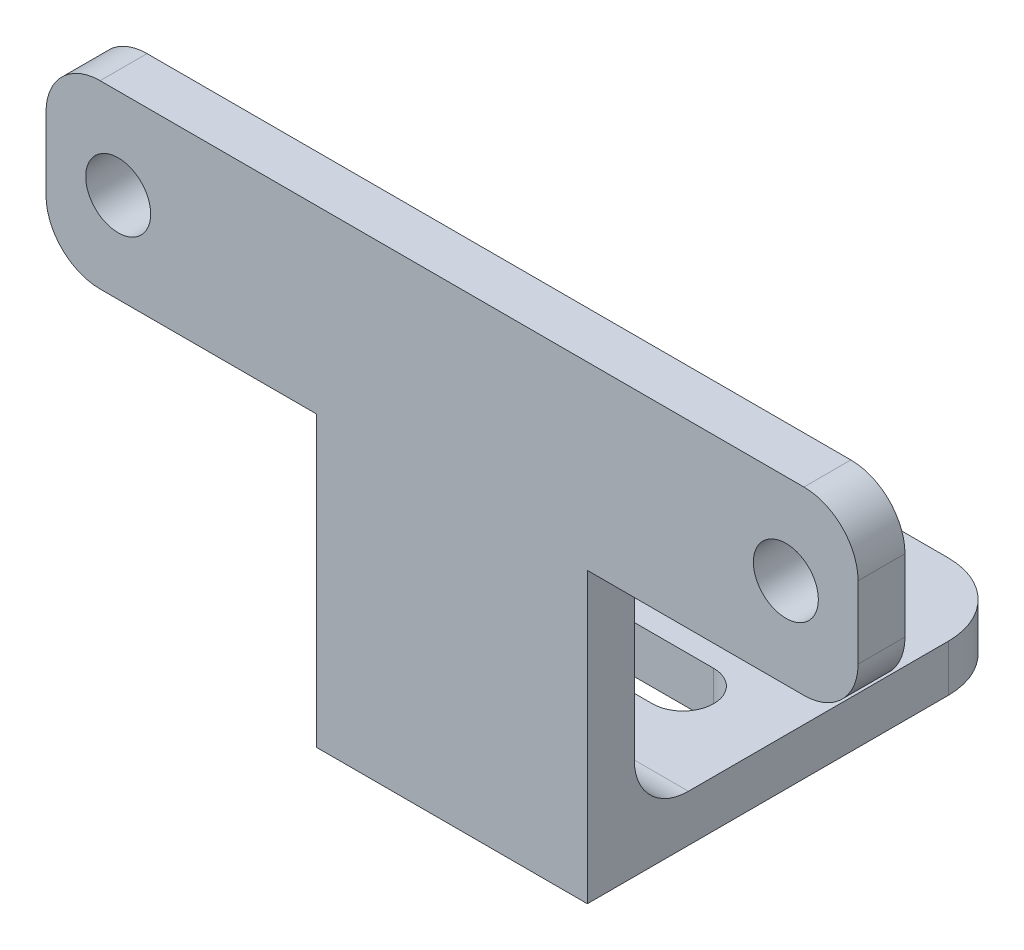
ISO-10303-21;
HEADER;
FILE_DESCRIPTION(('STEP AP214'),'2;1');
FILE_NAME('part.step','',(''),(''),'','','');
FILE_SCHEMA(('AUTOMOTIVE_DESIGN { 1 0 10303 214 1 1 1 1 }'));
ENDSEC;
DATA;
#1=APPLICATION_CONTEXT('core data for automotive mechanical design processes');
#2=APPLICATION_PROTOCOL_DEFINITION('international standard','automotive_design',2000,#1);
#3=PRODUCT_CONTEXT('',#1,'mechanical');
#4=PRODUCT('Part','Part','',(#3));
#5=PRODUCT_RELATED_PRODUCT_CATEGORY('part','',(#4));
#6=PRODUCT_DEFINITION_FORMATION('','',#4);
#7=PRODUCT_DEFINITION_CONTEXT('part definition',#1,'design');
#8=PRODUCT_DEFINITION('design','',#6,#7);
#9=PRODUCT_DEFINITION_SHAPE('','',#8);
#10=(LENGTH_UNIT() NAMED_UNIT(*) SI_UNIT(.MILLI.,.METRE.));
#11=(NAMED_UNIT(*) PLANE_ANGLE_UNIT() SI_UNIT($,.RADIAN.));
#12=(NAMED_UNIT(*) SI_UNIT($,.STERADIAN.) SOLID_ANGLE_UNIT());
#13=UNCERTAINTY_MEASURE_WITH_UNIT(LENGTH_MEASURE(1.E-05),#10,'distance_accuracy_value','');
#14=(GEOMETRIC_REPRESENTATION_CONTEXT(3) GLOBAL_UNCERTAINTY_ASSIGNED_CONTEXT((#13)) GLOBAL_UNIT_ASSIGNED_CONTEXT((#10,
#11,#12)) REPRESENTATION_CONTEXT('',''));
#15=CARTESIAN_POINT('',(0.,0.,0.));
#16=DIRECTION('',(0.,0.,1.));
#17=DIRECTION('',(1.,0.,0.));
#18=AXIS2_PLACEMENT_3D('',#15,#16,#17);
#19=CARTESIAN_POINT('',(-7.5,2.6,-24.));
#20=DIRECTION('',(1.,0.,0.));
#21=DIRECTION('',(0.,0.,-1.));
#22=AXIS2_PLACEMENT_3D('',#19,#20,#21);
#23=PLANE('',#22);
#24=DIRECTION('',(0.,0.,1.));
#25=VECTOR('',#24,1.);
#26=CARTESIAN_POINT('',(-7.5,2.6,-24.));
#27=LINE('',#26,#25);
#28=CARTESIAN_POINT('',(-7.5,2.6,-20.));
#29=VERTEX_POINT('',#28);
#30=CARTESIAN_POINT('',(-7.5,2.6,-5.6));
#31=VERTEX_POINT('',#30);
#32=EDGE_CURVE('E452',#29,#31,#27,.T.);
#33=ORIENTED_EDGE('',*,*,#32,.F.);
#34=DIRECTION('',(0.,-1.,0.));
#35=VECTOR('',#34,1.);
#36=CARTESIAN_POINT('',(-7.5,2.6,-20.));
#37=LINE('',#36,#35);
#38=CARTESIAN_POINT('',(-7.5,0.,-20.));
#39=VERTEX_POINT('',#38);
#40=EDGE_CURVE('E475',#29,#39,#37,.T.);
#41=ORIENTED_EDGE('',*,*,#40,.T.);
#42=DIRECTION('',(0.,0.,1.));
#43=VECTOR('',#42,1.);
#44=CARTESIAN_POINT('',(-7.5,0.,-24.));
#45=LINE('',#44,#43);
#46=CARTESIAN_POINT('',(-7.5,0.,0.));
#47=VERTEX_POINT('',#46);
#48=EDGE_CURVE('E449',#39,#47,#45,.T.);
#49=ORIENTED_EDGE('',*,*,#48,.T.);
#50=DIRECTION('',(0.,-1.,0.));
#51=VECTOR('',#50,1.);
#52=CARTESIAN_POINT('',(-7.5,2.6,0.));
#53=LINE('',#52,#51);
#54=CARTESIAN_POINT('',(-7.50000000000001,16.,0.));
#55=VERTEX_POINT('',#54);
#56=EDGE_CURVE('E472',#55,#47,#53,.T.);
#57=ORIENTED_EDGE('',*,*,#56,.F.);
#58=DIRECTION('',(0.,0.,1.));
#59=VECTOR('',#58,1.);
#60=CARTESIAN_POINT('',(-7.50000000000001,16.,-2.6));
#61=LINE('',#60,#59);
#62=CARTESIAN_POINT('',(-7.50000000000001,16.,-2.6));
#63=VERTEX_POINT('',#62);
#64=EDGE_CURVE('E446',#63,#55,#61,.T.);
#65=ORIENTED_EDGE('',*,*,#64,.F.);
#66=DIRECTION('',(0.,1.,0.));
#67=VECTOR('',#66,1.);
#68=CARTESIAN_POINT('',(-7.5,0.,-2.6));
#69=LINE('',#68,#67);
#70=CARTESIAN_POINT('',(-7.5,5.6,-2.6));
#71=VERTEX_POINT('',#70);
#72=EDGE_CURVE('E432',#71,#63,#69,.T.);
#73=ORIENTED_EDGE('',*,*,#72,.F.);
#74=CARTESIAN_POINT('',(-7.5,5.6,-5.6));
#75=DIRECTION('',(1.,0.,0.));
#76=DIRECTION('',(0.,0.,-1.));
#77=AXIS2_PLACEMENT_3D('',#74,#75,#76);
#78=CIRCLE('',#77,3.);
#79=EDGE_CURVE('E537',#71,#31,#78,.T.);
#80=ORIENTED_EDGE('',*,*,#79,.T.);
#81=EDGE_LOOP('',(#33,#41,#49,#57,#65,#73,#80));
#82=FACE_BOUND('',#81,.T.);
#83=ADVANCED_FACE('F185',(#82),#23,.F.);
#84=CARTESIAN_POINT('',(-7.5,2.6,0.));
#85=DIRECTION('',(0.,0.,-1.));
#86=DIRECTION('',(-1.,0.,0.));
#87=AXIS2_PLACEMENT_3D('',#84,#85,#86);
#88=PLANE('',#87);
#89=CARTESIAN_POINT('',(-18.5,21.,0.));
#90=DIRECTION('',(0.,0.,1.));
#91=DIRECTION('',(1.,0.,0.));
#92=AXIS2_PLACEMENT_3D('',#89,#90,#91);
#93=CIRCLE('',#92,1.8);
#94=CARTESIAN_POINT('',(-16.7,21.,0.));
#95=VERTEX_POINT('',#94);
#96=EDGE_CURVE('E405',#95,#95,#93,.T.);
#97=ORIENTED_EDGE('',*,*,#96,.F.);
#98=EDGE_LOOP('',(#97));
#99=FACE_BOUND('',#98,.T.);
#100=CARTESIAN_POINT('',(18.5,21.,0.));
#101=DIRECTION('',(0.,0.,1.));
#102=DIRECTION('',(1.,0.,0.));
#103=AXIS2_PLACEMENT_3D('',#100,#101,#102);
#104=CIRCLE('',#103,1.8);
#105=CARTESIAN_POINT('',(20.3,21.,0.));
#106=VERTEX_POINT('',#105);
#107=EDGE_CURVE('E409',#106,#106,#104,.T.);
#108=ORIENTED_EDGE('',*,*,#107,.F.);
#109=EDGE_LOOP('',(#108));
#110=FACE_BOUND('',#109,.T.);
#111=DIRECTION('',(0.,1.,0.));
#112=VECTOR('',#111,1.);
#113=CARTESIAN_POINT('',(-22.5,0.,0.));
#114=LINE('',#113,#112);
#115=CARTESIAN_POINT('',(-22.5,19.,0.));
#116=VERTEX_POINT('',#115);
#117=CARTESIAN_POINT('',(-22.5,23.,0.));
#118=VERTEX_POINT('',#117);
#119=EDGE_CURVE('E443',#116,#118,#114,.T.);
#120=ORIENTED_EDGE('',*,*,#119,.F.);
#121=CARTESIAN_POINT('',(-19.5,19.,0.));
#122=DIRECTION('',(0.,0.,-1.));
#123=DIRECTION('',(-1.,0.,0.));
#124=AXIS2_PLACEMENT_3D('',#121,#122,#123);
#125=CIRCLE('',#124,3.);
#126=CARTESIAN_POINT('',(-19.5,16.,0.));
#127=VERTEX_POINT('',#126);
#128=EDGE_CURVE('E507',#116,#127,#125,.F.);
#129=ORIENTED_EDGE('',*,*,#128,.T.);
#130=DIRECTION('',(1.,0.,0.));
#131=VECTOR('',#130,1.);
#132=CARTESIAN_POINT('',(0.,16.,0.));
#133=LINE('',#132,#131);
#134=EDGE_CURVE('E419',#127,#55,#133,.T.);
#135=ORIENTED_EDGE('',*,*,#134,.T.);
#136=ORIENTED_EDGE('',*,*,#56,.T.);
#137=DIRECTION('',(1.,0.,0.));
#138=VECTOR('',#137,1.);
#139=CARTESIAN_POINT('',(-7.5,0.,0.));
#140=LINE('',#139,#138);
#141=CARTESIAN_POINT('',(7.5,0.,0.));
#142=VERTEX_POINT('',#141);
#143=EDGE_CURVE('E463',#47,#142,#140,.T.);
#144=ORIENTED_EDGE('',*,*,#143,.T.);
#145=DIRECTION('',(0.,-1.,0.));
#146=VECTOR('',#145,1.);
#147=CARTESIAN_POINT('',(7.5,2.6,0.));
#148=LINE('',#147,#146);
#149=CARTESIAN_POINT('',(7.5,16.,0.));
#150=VERTEX_POINT('',#149);
#151=EDGE_CURVE('E461',#150,#142,#148,.T.);
#152=ORIENTED_EDGE('',*,*,#151,.F.);
#153=CARTESIAN_POINT('',(19.5,16.,0.));
#154=VERTEX_POINT('',#153);
#155=EDGE_CURVE('E415',#150,#154,#133,.T.);
#156=ORIENTED_EDGE('',*,*,#155,.T.);
#157=CARTESIAN_POINT('',(19.5,19.,0.));
#158=DIRECTION('',(0.,0.,-1.));
#159=DIRECTION('',(-1.,0.,0.));
#160=AXIS2_PLACEMENT_3D('',#157,#158,#159);
#161=CIRCLE('',#160,3.);
#162=CARTESIAN_POINT('',(22.5,19.,0.));
#163=VERTEX_POINT('',#162);
#164=EDGE_CURVE('E503',#154,#163,#161,.F.);
#165=ORIENTED_EDGE('',*,*,#164,.T.);
#166=DIRECTION('',(0.,1.,0.));
#167=VECTOR('',#166,1.);
#168=CARTESIAN_POINT('',(22.5,0.,0.));
#169=LINE('',#168,#167);
#170=CARTESIAN_POINT('',(22.5,23.,0.));
#171=VERTEX_POINT('',#170);
#172=EDGE_CURVE('E437',#163,#171,#169,.T.);
#173=ORIENTED_EDGE('',*,*,#172,.T.);
#174=CARTESIAN_POINT('',(19.5,23.,0.));
#175=DIRECTION('',(0.,0.,-1.));
#176=DIRECTION('',(-1.,0.,0.));
#177=AXIS2_PLACEMENT_3D('',#174,#175,#176);
#178=CIRCLE('',#177,3.);
#179=CARTESIAN_POINT('',(19.5,26.,0.));
#180=VERTEX_POINT('',#179);
#181=EDGE_CURVE('E501',#171,#180,#178,.F.);
#182=ORIENTED_EDGE('',*,*,#181,.T.);
#183=DIRECTION('',(1.,0.,0.));
#184=VECTOR('',#183,1.);
#185=CARTESIAN_POINT('',(0.,26.,0.));
#186=LINE('',#185,#184);
#187=CARTESIAN_POINT('',(-19.5,26.,0.));
#188=VERTEX_POINT('',#187);
#189=EDGE_CURVE('E440',#188,#180,#186,.T.);
#190=ORIENTED_EDGE('',*,*,#189,.F.);
#191=CARTESIAN_POINT('',(-19.5,23.,0.));
#192=DIRECTION('',(0.,0.,-1.));
#193=DIRECTION('',(-1.,0.,0.));
#194=AXIS2_PLACEMENT_3D('',#191,#192,#193);
#195=CIRCLE('',#194,3.);
#196=EDGE_CURVE('E505',#188,#118,#195,.F.);
#197=ORIENTED_EDGE('',*,*,#196,.T.);
#198=EDGE_LOOP('',(#120,#129,#135,#136,#144,#152,#156,#165,#173,#182,#190,#197));
#199=FACE_BOUND('',#198,.T.);
#200=ADVANCED_FACE('F567',(#99,#110,#199),#88,.F.);
#201=CARTESIAN_POINT('',(7.5,2.6,-24.));
#202=DIRECTION('',(-1.,0.,0.));
#203=DIRECTION('',(0.,0.,1.));
#204=AXIS2_PLACEMENT_3D('',#201,#202,#203);
#205=PLANE('',#204);
#206=DIRECTION('',(0.,0.,-1.));
#207=VECTOR('',#206,1.);
#208=CARTESIAN_POINT('',(7.5,0.,-24.));
#209=LINE('',#208,#207);
#210=CARTESIAN_POINT('',(7.5,0.,-20.));
#211=VERTEX_POINT('',#210);
#212=EDGE_CURVE('E465',#142,#211,#209,.T.);
#213=ORIENTED_EDGE('',*,*,#212,.T.);
#214=DIRECTION('',(0.,-1.,0.));
#215=VECTOR('',#214,1.);
#216=CARTESIAN_POINT('',(7.5,2.6,-20.));
#217=LINE('',#216,#215);
#218=CARTESIAN_POINT('',(7.5,2.6,-20.));
#219=VERTEX_POINT('',#218);
#220=EDGE_CURVE('E491',#211,#219,#217,.F.);
#221=ORIENTED_EDGE('',*,*,#220,.T.);
#222=DIRECTION('',(0.,0.,-1.));
#223=VECTOR('',#222,1.);
#224=CARTESIAN_POINT('',(7.5,2.6,-24.));
#225=LINE('',#224,#223);
#226=CARTESIAN_POINT('',(7.5,2.6,-5.6));
#227=VERTEX_POINT('',#226);
#228=EDGE_CURVE('E455',#227,#219,#225,.T.);
#229=ORIENTED_EDGE('',*,*,#228,.F.);
#230=CARTESIAN_POINT('',(7.5,5.6,-5.6));
#231=DIRECTION('',(-1.,0.,0.));
#232=DIRECTION('',(0.,0.,1.));
#233=AXIS2_PLACEMENT_3D('',#230,#231,#232);
#234=CIRCLE('',#233,3.);
#235=CARTESIAN_POINT('',(7.5,5.6,-2.6));
#236=VERTEX_POINT('',#235);
#237=EDGE_CURVE('E539',#227,#236,#234,.T.);
#238=ORIENTED_EDGE('',*,*,#237,.T.);
#239=DIRECTION('',(0.,1.,0.));
#240=VECTOR('',#239,1.);
#241=CARTESIAN_POINT('',(7.5,0.,-2.6));
#242=LINE('',#241,#240);
#243=CARTESIAN_POINT('',(7.5,16.,-2.6));
#244=VERTEX_POINT('',#243);
#245=EDGE_CURVE('E416',#236,#244,#242,.T.);
#246=ORIENTED_EDGE('',*,*,#245,.T.);
#247=DIRECTION('',(0.,0.,1.));
#248=VECTOR('',#247,1.);
#249=CARTESIAN_POINT('',(7.5,16.,-2.6));
#250=LINE('',#249,#248);
#251=EDGE_CURVE('E434',#244,#150,#250,.T.);
#252=ORIENTED_EDGE('',*,*,#251,.T.);
#253=ORIENTED_EDGE('',*,*,#151,.T.);
#254=EDGE_LOOP('',(#213,#221,#229,#238,#246,#252,#253));
#255=FACE_BOUND('',#254,.T.);
#256=ADVANCED_FACE('F573',(#255),#205,.F.);
#257=CARTESIAN_POINT('',(-7.5,2.6,-24.));
#258=DIRECTION('',(0.,0.,1.));
#259=DIRECTION('',(1.,0.,0.));
#260=AXIS2_PLACEMENT_3D('',#257,#258,#259);
#261=PLANE('',#260);
#262=DIRECTION('',(-1.,0.,0.));
#263=VECTOR('',#262,1.);
#264=CARTESIAN_POINT('',(-7.5,0.,-24.));
#265=LINE('',#264,#263);
#266=CARTESIAN_POINT('',(3.5,0.,-24.));
#267=VERTEX_POINT('',#266);
#268=CARTESIAN_POINT('',(-3.5,0.,-24.));
#269=VERTEX_POINT('',#268);
#270=EDGE_CURVE('E456',#267,#269,#265,.T.);
#271=ORIENTED_EDGE('',*,*,#270,.T.);
#272=DIRECTION('',(0.,-1.,0.));
#273=VECTOR('',#272,1.);
#274=CARTESIAN_POINT('',(-3.5,2.6,-24.));
#275=LINE('',#274,#273);
#276=CARTESIAN_POINT('',(-3.5,2.6,-24.));
#277=VERTEX_POINT('',#276);
#278=EDGE_CURVE('E485',#269,#277,#275,.F.);
#279=ORIENTED_EDGE('',*,*,#278,.T.);
#280=DIRECTION('',(-1.,0.,0.));
#281=VECTOR('',#280,1.);
#282=CARTESIAN_POINT('',(-7.5,2.6,-24.));
#283=LINE('',#282,#281);
#284=CARTESIAN_POINT('',(3.5,2.6,-24.));
#285=VERTEX_POINT('',#284);
#286=EDGE_CURVE('E458',#285,#277,#283,.T.);
#287=ORIENTED_EDGE('',*,*,#286,.F.);
#288=DIRECTION('',(0.,-1.,0.));
#289=VECTOR('',#288,1.);
#290=CARTESIAN_POINT('',(3.5,2.6,-24.));
#291=LINE('',#290,#289);
#292=EDGE_CURVE('E482',#285,#267,#291,.T.);
#293=ORIENTED_EDGE('',*,*,#292,.T.);
#294=EDGE_LOOP('',(#271,#279,#287,#293));
#295=FACE_BOUND('',#294,.T.);
#296=ADVANCED_FACE('F676',(#295),#261,.F.);
#297=CARTESIAN_POINT('',(0.,2.6,0.));
#298=DIRECTION('',(0.,1.,0.));
#299=DIRECTION('',(0.,0.,1.));
#300=AXIS2_PLACEMENT_3D('',#297,#298,#299);
#301=PLANE('',#300);
#302=DIRECTION('',(1.,0.,0.));
#303=VECTOR('',#302,1.);
#304=CARTESIAN_POINT('',(-2.3,2.6,-16.8));
#305=LINE('',#304,#303);
#306=CARTESIAN_POINT('',(-2.3,2.6,-16.8));
#307=VERTEX_POINT('',#306);
#308=CARTESIAN_POINT('',(2.3,2.6,-16.8));
#309=VERTEX_POINT('',#308);
#310=EDGE_CURVE('E370',#307,#309,#305,.T.);
#311=ORIENTED_EDGE('',*,*,#310,.F.);
#312=CARTESIAN_POINT('',(-2.3,2.6,-18.5));
#313=DIRECTION('',(0.,1.,0.));
#314=DIRECTION('',(0.,0.,1.));
#315=AXIS2_PLACEMENT_3D('',#312,#313,#314);
#316=CIRCLE('',#315,1.69999999999999);
#317=CARTESIAN_POINT('',(-2.3,2.6,-20.2));
#318=VERTEX_POINT('',#317);
#319=EDGE_CURVE('E369',#318,#307,#316,.T.);
#320=ORIENTED_EDGE('',*,*,#319,.F.);
#321=DIRECTION('',(1.,0.,0.));
#322=VECTOR('',#321,1.);
#323=CARTESIAN_POINT('',(-2.3,2.6,-20.2));
#324=LINE('',#323,#322);
#325=CARTESIAN_POINT('',(2.3,2.6,-20.2));
#326=VERTEX_POINT('',#325);
#327=EDGE_CURVE('E356',#318,#326,#324,.T.);
#328=ORIENTED_EDGE('',*,*,#327,.T.);
#329=CARTESIAN_POINT('',(2.3,2.6,-18.5));
#330=DIRECTION('',(0.,1.,0.));
#331=DIRECTION('',(0.,0.,1.));
#332=AXIS2_PLACEMENT_3D('',#329,#330,#331);
#333=CIRCLE('',#332,1.69999999999999);
#334=EDGE_CURVE('E360',#309,#326,#333,.T.);
#335=ORIENTED_EDGE('',*,*,#334,.F.);
#336=EDGE_LOOP('',(#311,#320,#328,#335));
#337=FACE_BOUND('',#336,.T.);
#338=CARTESIAN_POINT('',(2.3,2.6,-10.5));
#339=DIRECTION('',(0.,1.,0.));
#340=DIRECTION('',(0.,0.,1.));
#341=AXIS2_PLACEMENT_3D('',#338,#339,#340);
#342=CIRCLE('',#341,1.69999999999999);
#343=CARTESIAN_POINT('',(2.3,2.6,-8.80000000000004));
#344=VERTEX_POINT('',#343);
#345=CARTESIAN_POINT('',(2.3,2.6,-12.2));
#346=VERTEX_POINT('',#345);
#347=EDGE_CURVE('E395',#344,#346,#342,.T.);
#348=ORIENTED_EDGE('',*,*,#347,.F.);
#349=DIRECTION('',(1.,0.,0.));
#350=VECTOR('',#349,1.);
#351=CARTESIAN_POINT('',(-2.3,2.6,-8.80000000000004));
#352=LINE('',#351,#350);
#353=CARTESIAN_POINT('',(-2.3,2.6,-8.80000000000001));
#354=VERTEX_POINT('',#353);
#355=EDGE_CURVE('E382',#354,#344,#352,.T.);
#356=ORIENTED_EDGE('',*,*,#355,.F.);
#357=CARTESIAN_POINT('',(-2.3,2.6,-10.5));
#358=DIRECTION('',(0.,1.,0.));
#359=DIRECTION('',(0.,0.,1.));
#360=AXIS2_PLACEMENT_3D('',#357,#358,#359);
#361=CIRCLE('',#360,1.69999999999999);
#362=CARTESIAN_POINT('',(-2.3,2.6,-12.2));
#363=VERTEX_POINT('',#362);
#364=EDGE_CURVE('E387',#363,#354,#361,.T.);
#365=ORIENTED_EDGE('',*,*,#364,.F.);
#366=DIRECTION('',(1.,0.,0.));
#367=VECTOR('',#366,1.);
#368=CARTESIAN_POINT('',(-2.3,2.6,-12.2));
#369=LINE('',#368,#367);
#370=EDGE_CURVE('E384',#363,#346,#369,.T.);
#371=ORIENTED_EDGE('',*,*,#370,.T.);
#372=EDGE_LOOP('',(#348,#356,#365,#371));
#373=FACE_BOUND('',#372,.T.);
#374=ORIENTED_EDGE('',*,*,#32,.T.);
#375=DIRECTION('',(-1.,0.,0.));
#376=VECTOR('',#375,1.);
#377=CARTESIAN_POINT('',(0.,2.6,-5.6));
#378=LINE('',#377,#376);
#379=EDGE_CURVE('E535',#31,#227,#378,.F.);
#380=ORIENTED_EDGE('',*,*,#379,.T.);
#381=ORIENTED_EDGE('',*,*,#228,.T.);
#382=CARTESIAN_POINT('',(3.5,2.6,-20.));
#383=DIRECTION('',(0.,1.,0.));
#384=DIRECTION('',(0.,0.,1.));
#385=AXIS2_PLACEMENT_3D('',#382,#383,#384);
#386=CIRCLE('',#385,4.);
#387=EDGE_CURVE('E487',#219,#285,#386,.T.);
#388=ORIENTED_EDGE('',*,*,#387,.T.);
#389=ORIENTED_EDGE('',*,*,#286,.T.);
#390=CARTESIAN_POINT('',(-3.5,2.6,-20.));
#391=DIRECTION('',(0.,1.,0.));
#392=DIRECTION('',(0.,0.,1.));
#393=AXIS2_PLACEMENT_3D('',#390,#391,#392);
#394=CIRCLE('',#393,4.);
#395=EDGE_CURVE('E489',#277,#29,#394,.T.);
#396=ORIENTED_EDGE('',*,*,#395,.T.);
#397=EDGE_LOOP('',(#374,#380,#381,#388,#389,#396));
#398=FACE_BOUND('',#397,.T.);
#399=ADVANCED_FACE('F367',(#337,#373,#398),#301,.T.);
#400=CARTESIAN_POINT('',(0.,0.,0.));
#401=DIRECTION('',(0.,1.,0.));
#402=DIRECTION('',(0.,0.,1.));
#403=AXIS2_PLACEMENT_3D('',#400,#401,#402);
#404=PLANE('',#403);
#405=CARTESIAN_POINT('',(2.3,0.,-18.5));
#406=DIRECTION('',(0.,1.,0.));
#407=DIRECTION('',(0.,0.,1.));
#408=AXIS2_PLACEMENT_3D('',#405,#406,#407);
#409=CIRCLE('',#408,1.69999999999999);
#410=CARTESIAN_POINT('',(2.3,0.,-16.8));
#411=VERTEX_POINT('',#410);
#412=CARTESIAN_POINT('',(2.3,0.,-20.2));
#413=VERTEX_POINT('',#412);
#414=EDGE_CURVE('E193',#411,#413,#409,.T.);
#415=ORIENTED_EDGE('',*,*,#414,.T.);
#416=DIRECTION('',(-1.,0.,0.));
#417=VECTOR('',#416,1.);
#418=CARTESIAN_POINT('',(0.,0.,-20.2));
#419=LINE('',#418,#417);
#420=CARTESIAN_POINT('',(-2.3,0.,-20.2));
#421=VERTEX_POINT('',#420);
#422=EDGE_CURVE('E13',#413,#421,#419,.T.);
#423=ORIENTED_EDGE('',*,*,#422,.T.);
#424=CARTESIAN_POINT('',(-2.3,0.,-18.5));
#425=DIRECTION('',(0.,1.,0.));
#426=DIRECTION('',(0.,0.,1.));
#427=AXIS2_PLACEMENT_3D('',#424,#425,#426);
#428=CIRCLE('',#427,1.69999999999999);
#429=CARTESIAN_POINT('',(-2.3,0.,-16.8));
#430=VERTEX_POINT('',#429);
#431=EDGE_CURVE('E379',#421,#430,#428,.T.);
#432=ORIENTED_EDGE('',*,*,#431,.T.);
#433=DIRECTION('',(1.,0.,0.));
#434=VECTOR('',#433,1.);
#435=CARTESIAN_POINT('',(0.,0.,-16.8));
#436=LINE('',#435,#434);
#437=EDGE_CURVE('E550',#430,#411,#436,.T.);
#438=ORIENTED_EDGE('',*,*,#437,.T.);
#439=EDGE_LOOP('',(#415,#423,#432,#438));
#440=FACE_BOUND('',#439,.T.);
#441=CARTESIAN_POINT('',(2.3,0.,-10.5));
#442=DIRECTION('',(0.,1.,0.));
#443=DIRECTION('',(0.,0.,1.));
#444=AXIS2_PLACEMENT_3D('',#441,#442,#443);
#445=CIRCLE('',#444,1.69999999999999);
#446=CARTESIAN_POINT('',(2.3,0.,-8.80000000000002));
#447=VERTEX_POINT('',#446);
#448=CARTESIAN_POINT('',(2.3,0.,-12.2));
#449=VERTEX_POINT('',#448);
#450=EDGE_CURVE('E402',#447,#449,#445,.T.);
#451=ORIENTED_EDGE('',*,*,#450,.T.);
#452=DIRECTION('',(-1.,0.,0.));
#453=VECTOR('',#452,1.);
#454=CARTESIAN_POINT('',(0.,0.,-12.2));
#455=LINE('',#454,#453);
#456=CARTESIAN_POINT('',(-2.3,0.,-12.2));
#457=VERTEX_POINT('',#456);
#458=EDGE_CURVE('E547',#449,#457,#455,.T.);
#459=ORIENTED_EDGE('',*,*,#458,.T.);
#460=CARTESIAN_POINT('',(-2.3,0.,-10.5));
#461=DIRECTION('',(0.,1.,0.));
#462=DIRECTION('',(0.,0.,1.));
#463=AXIS2_PLACEMENT_3D('',#460,#461,#462);
#464=CIRCLE('',#463,1.69999999999999);
#465=CARTESIAN_POINT('',(-2.3,0.,-8.80000000000002));
#466=VERTEX_POINT('',#465);
#467=EDGE_CURVE('E544',#457,#466,#464,.T.);
#468=ORIENTED_EDGE('',*,*,#467,.T.);
#469=DIRECTION('',(1.,0.,0.));
#470=VECTOR('',#469,1.);
#471=CARTESIAN_POINT('',(0.,0.,-8.80000000000002));
#472=LINE('',#471,#470);
#473=EDGE_CURVE('E541',#466,#447,#472,.T.);
#474=ORIENTED_EDGE('',*,*,#473,.T.);
#475=EDGE_LOOP('',(#451,#459,#468,#474));
#476=FACE_BOUND('',#475,.T.);
#477=ORIENTED_EDGE('',*,*,#48,.F.);
#478=CARTESIAN_POINT('',(-3.5,0.,-20.));
#479=DIRECTION('',(0.,1.,0.));
#480=DIRECTION('',(0.,0.,1.));
#481=AXIS2_PLACEMENT_3D('',#478,#479,#480);
#482=CIRCLE('',#481,4.);
#483=EDGE_CURVE('E480',#39,#269,#482,.F.);
#484=ORIENTED_EDGE('',*,*,#483,.T.);
#485=ORIENTED_EDGE('',*,*,#270,.F.);
#486=CARTESIAN_POINT('',(3.5,0.,-20.));
#487=DIRECTION('',(0.,1.,0.));
#488=DIRECTION('',(0.,0.,1.));
#489=AXIS2_PLACEMENT_3D('',#486,#487,#488);
#490=CIRCLE('',#489,4.);
#491=EDGE_CURVE('E478',#267,#211,#490,.F.);
#492=ORIENTED_EDGE('',*,*,#491,.T.);
#493=ORIENTED_EDGE('',*,*,#212,.F.);
#494=ORIENTED_EDGE('',*,*,#143,.F.);
#495=EDGE_LOOP('',(#477,#484,#485,#492,#493,#494));
#496=FACE_BOUND('',#495,.T.);
#497=ADVANCED_FACE('F553',(#440,#476,#496),#404,.F.);
#498=CARTESIAN_POINT('',(0.,16.,-2.6));
#499=DIRECTION('',(0.,-1.,0.));
#500=DIRECTION('',(1.,0.,0.));
#501=AXIS2_PLACEMENT_3D('',#498,#499,#500);
#502=PLANE('',#501);
#503=ORIENTED_EDGE('',*,*,#134,.F.);
#504=DIRECTION('',(0.,0.,1.));
#505=VECTOR('',#504,1.);
#506=CARTESIAN_POINT('',(-19.5,16.,-2.6));
#507=LINE('',#506,#505);
#508=CARTESIAN_POINT('',(-19.5,16.,-2.6));
#509=VERTEX_POINT('',#508);
#510=EDGE_CURVE('E509',#127,#509,#507,.F.);
#511=ORIENTED_EDGE('',*,*,#510,.T.);
#512=DIRECTION('',(1.,0.,0.));
#513=VECTOR('',#512,1.);
#514=CARTESIAN_POINT('',(0.,16.,-2.6));
#515=LINE('',#514,#513);
#516=EDGE_CURVE('E423',#509,#63,#515,.T.);
#517=ORIENTED_EDGE('',*,*,#516,.T.);
#518=ORIENTED_EDGE('',*,*,#64,.T.);
#519=EDGE_LOOP('',(#503,#511,#517,#518));
#520=FACE_BOUND('',#519,.T.);
#521=ADVANCED_FACE('F650',(#520),#502,.T.);
#522=CARTESIAN_POINT('',(-22.5,0.,-2.6));
#523=DIRECTION('',(1.,0.,0.));
#524=DIRECTION('',(0.,1.,0.));
#525=AXIS2_PLACEMENT_3D('',#522,#523,#524);
#526=PLANE('',#525);
#527=DIRECTION('',(0.,1.,0.));
#528=VECTOR('',#527,1.);
#529=CARTESIAN_POINT('',(-22.5,0.,-2.6));
#530=LINE('',#529,#528);
#531=CARTESIAN_POINT('',(-22.5,19.,-2.6));
#532=VERTEX_POINT('',#531);
#533=CARTESIAN_POINT('',(-22.5,23.,-2.6));
#534=VERTEX_POINT('',#533);
#535=EDGE_CURVE('E429',#532,#534,#530,.T.);
#536=ORIENTED_EDGE('',*,*,#535,.F.);
#537=DIRECTION('',(0.,0.,1.));
#538=VECTOR('',#537,1.);
#539=CARTESIAN_POINT('',(-22.5,19.,0.));
#540=LINE('',#539,#538);
#541=EDGE_CURVE('E498',#532,#116,#540,.T.);
#542=ORIENTED_EDGE('',*,*,#541,.T.);
#543=ORIENTED_EDGE('',*,*,#119,.T.);
#544=DIRECTION('',(0.,0.,1.));
#545=VECTOR('',#544,1.);
#546=CARTESIAN_POINT('',(-22.5,23.,-2.6));
#547=LINE('',#546,#545);
#548=EDGE_CURVE('E494',#118,#534,#547,.F.);
#549=ORIENTED_EDGE('',*,*,#548,.T.);
#550=EDGE_LOOP('',(#536,#542,#543,#549));
#551=FACE_BOUND('',#550,.T.);
#552=ADVANCED_FACE('F657',(#551),#526,.F.);
#553=CARTESIAN_POINT('',(0.,26.,-2.6));
#554=DIRECTION('',(0.,-1.,0.));
#555=DIRECTION('',(1.,0.,0.));
#556=AXIS2_PLACEMENT_3D('',#553,#554,#555);
#557=PLANE('',#556);
#558=DIRECTION('',(1.,0.,0.));
#559=VECTOR('',#558,1.);
#560=CARTESIAN_POINT('',(0.,26.,-2.6));
#561=LINE('',#560,#559);
#562=CARTESIAN_POINT('',(-19.5,26.,-2.6));
#563=VERTEX_POINT('',#562);
#564=CARTESIAN_POINT('',(19.5,26.,-2.6));
#565=VERTEX_POINT('',#564);
#566=EDGE_CURVE('E426',#563,#565,#561,.T.);
#567=ORIENTED_EDGE('',*,*,#566,.F.);
#568=DIRECTION('',(0.,0.,1.));
#569=VECTOR('',#568,1.);
#570=CARTESIAN_POINT('',(-19.5,26.,-2.6));
#571=LINE('',#570,#569);
#572=EDGE_CURVE('E521',#563,#188,#571,.T.);
#573=ORIENTED_EDGE('',*,*,#572,.T.);
#574=ORIENTED_EDGE('',*,*,#189,.T.);
#575=DIRECTION('',(0.,0.,1.));
#576=VECTOR('',#575,1.);
#577=CARTESIAN_POINT('',(19.5,26.,-2.6));
#578=LINE('',#577,#576);
#579=EDGE_CURVE('E519',#180,#565,#578,.F.);
#580=ORIENTED_EDGE('',*,*,#579,.T.);
#581=EDGE_LOOP('',(#567,#573,#574,#580));
#582=FACE_BOUND('',#581,.T.);
#583=ADVANCED_FACE('F663',(#582),#557,.F.);
#584=CARTESIAN_POINT('',(22.5,0.,-2.6));
#585=DIRECTION('',(1.,0.,0.));
#586=DIRECTION('',(0.,0.,-1.));
#587=AXIS2_PLACEMENT_3D('',#584,#585,#586);
#588=PLANE('',#587);
#589=ORIENTED_EDGE('',*,*,#172,.F.);
#590=DIRECTION('',(0.,0.,1.));
#591=VECTOR('',#590,1.);
#592=CARTESIAN_POINT('',(22.5,19.,-2.6));
#593=LINE('',#592,#591);
#594=CARTESIAN_POINT('',(22.5,19.,-2.6));
#595=VERTEX_POINT('',#594);
#596=EDGE_CURVE('E530',#163,#595,#593,.F.);
#597=ORIENTED_EDGE('',*,*,#596,.T.);
#598=DIRECTION('',(0.,1.,0.));
#599=VECTOR('',#598,1.);
#600=CARTESIAN_POINT('',(22.5,0.,-2.6));
#601=LINE('',#600,#599);
#602=CARTESIAN_POINT('',(22.5,23.,-2.6));
#603=VERTEX_POINT('',#602);
#604=EDGE_CURVE('E422',#595,#603,#601,.T.);
#605=ORIENTED_EDGE('',*,*,#604,.T.);
#606=DIRECTION('',(0.,0.,1.));
#607=VECTOR('',#606,1.);
#608=CARTESIAN_POINT('',(22.5,23.,0.));
#609=LINE('',#608,#607);
#610=EDGE_CURVE('E527',#603,#171,#609,.T.);
#611=ORIENTED_EDGE('',*,*,#610,.T.);
#612=EDGE_LOOP('',(#589,#597,#605,#611));
#613=FACE_BOUND('',#612,.T.);
#614=ADVANCED_FACE('F619',(#613),#588,.T.);
#615=CARTESIAN_POINT('',(19.5,16.,-2.6));
#616=VERTEX_POINT('',#615);
#617=EDGE_CURVE('E418',#244,#616,#515,.T.);
#618=ORIENTED_EDGE('',*,*,#617,.T.);
#619=DIRECTION('',(0.,0.,1.));
#620=VECTOR('',#619,1.);
#621=CARTESIAN_POINT('',(19.5,16.,-2.6));
#622=LINE('',#621,#620);
#623=EDGE_CURVE('E524',#616,#154,#622,.T.);
#624=ORIENTED_EDGE('',*,*,#623,.T.);
#625=ORIENTED_EDGE('',*,*,#155,.F.);
#626=ORIENTED_EDGE('',*,*,#251,.F.);
#627=EDGE_LOOP('',(#618,#624,#625,#626));
#628=FACE_BOUND('',#627,.T.);
#629=ADVANCED_FACE('F625',(#628),#502,.T.);
#630=CARTESIAN_POINT('',(0.,0.,-2.6));
#631=DIRECTION('',(0.,0.,1.));
#632=DIRECTION('',(1.,0.,0.));
#633=AXIS2_PLACEMENT_3D('',#630,#631,#632);
#634=PLANE('',#633);
#635=CARTESIAN_POINT('',(-18.5,21.,-2.6));
#636=DIRECTION('',(0.,0.,1.));
#637=DIRECTION('',(1.,0.,0.));
#638=AXIS2_PLACEMENT_3D('',#635,#636,#637);
#639=CIRCLE('',#638,1.79999999999999);
#640=CARTESIAN_POINT('',(-16.7,21.,-2.6));
#641=VERTEX_POINT('',#640);
#642=EDGE_CURVE('E408',#641,#641,#639,.T.);
#643=ORIENTED_EDGE('',*,*,#642,.T.);
#644=EDGE_LOOP('',(#643));
#645=FACE_BOUND('',#644,.T.);
#646=CARTESIAN_POINT('',(18.5,21.,-2.6));
#647=DIRECTION('',(0.,0.,1.));
#648=DIRECTION('',(1.,0.,0.));
#649=AXIS2_PLACEMENT_3D('',#646,#647,#648);
#650=CIRCLE('',#649,1.79999999999999);
#651=CARTESIAN_POINT('',(20.3,21.,-2.6));
#652=VERTEX_POINT('',#651);
#653=EDGE_CURVE('E412',#652,#652,#650,.T.);
#654=ORIENTED_EDGE('',*,*,#653,.T.);
#655=EDGE_LOOP('',(#654));
#656=FACE_BOUND('',#655,.T.);
#657=ORIENTED_EDGE('',*,*,#245,.F.);
#658=DIRECTION('',(-1.,0.,0.));
#659=VECTOR('',#658,1.);
#660=CARTESIAN_POINT('',(0.,5.6,-2.6));
#661=LINE('',#660,#659);
#662=EDGE_CURVE('E532',#236,#71,#661,.T.);
#663=ORIENTED_EDGE('',*,*,#662,.T.);
#664=ORIENTED_EDGE('',*,*,#72,.T.);
#665=ORIENTED_EDGE('',*,*,#516,.F.);
#666=CARTESIAN_POINT('',(-19.5,19.,-2.6));
#667=DIRECTION('',(0.,0.,1.));
#668=DIRECTION('',(1.,0.,0.));
#669=AXIS2_PLACEMENT_3D('',#666,#667,#668);
#670=CIRCLE('',#669,3.);
#671=EDGE_CURVE('E517',#509,#532,#670,.F.);
#672=ORIENTED_EDGE('',*,*,#671,.T.);
#673=ORIENTED_EDGE('',*,*,#535,.T.);
#674=CARTESIAN_POINT('',(-19.5,23.,-2.6));
#675=DIRECTION('',(0.,0.,1.));
#676=DIRECTION('',(1.,0.,0.));
#677=AXIS2_PLACEMENT_3D('',#674,#675,#676);
#678=CIRCLE('',#677,3.);
#679=EDGE_CURVE('E515',#534,#563,#678,.F.);
#680=ORIENTED_EDGE('',*,*,#679,.T.);
#681=ORIENTED_EDGE('',*,*,#566,.T.);
#682=CARTESIAN_POINT('',(19.5,23.,-2.6));
#683=DIRECTION('',(0.,0.,1.));
#684=DIRECTION('',(1.,0.,0.));
#685=AXIS2_PLACEMENT_3D('',#682,#683,#684);
#686=CIRCLE('',#685,3.);
#687=EDGE_CURVE('E511',#565,#603,#686,.F.);
#688=ORIENTED_EDGE('',*,*,#687,.T.);
#689=ORIENTED_EDGE('',*,*,#604,.F.);
#690=CARTESIAN_POINT('',(19.5,19.,-2.6));
#691=DIRECTION('',(0.,0.,1.));
#692=DIRECTION('',(1.,0.,0.));
#693=AXIS2_PLACEMENT_3D('',#690,#691,#692);
#694=CIRCLE('',#693,3.);
#695=EDGE_CURVE('E513',#595,#616,#694,.F.);
#696=ORIENTED_EDGE('',*,*,#695,.T.);
#697=ORIENTED_EDGE('',*,*,#617,.F.);
#698=EDGE_LOOP('',(#657,#663,#664,#665,#672,#673,#680,#681,#688,#689,#696,#697));
#699=FACE_BOUND('',#698,.T.);
#700=ADVANCED_FACE('F583',(#645,#656,#699),#634,.F.);
#701=CARTESIAN_POINT('',(-3.5,2.6,-20.));
#702=DIRECTION('',(0.,-1.,0.));
#703=DIRECTION('',(0.,0.,-1.));
#704=AXIS2_PLACEMENT_3D('',#701,#702,#703);
#705=CYLINDRICAL_SURFACE('',#704,4.);
#706=ORIENTED_EDGE('',*,*,#395,.F.);
#707=ORIENTED_EDGE('',*,*,#278,.F.);
#708=ORIENTED_EDGE('',*,*,#483,.F.);
#709=ORIENTED_EDGE('',*,*,#40,.F.);
#710=EDGE_LOOP('',(#706,#707,#708,#709));
#711=FACE_BOUND('',#710,.T.);
#712=ADVANCED_FACE('F579',(#711),#705,.T.);
#713=CARTESIAN_POINT('',(3.5,2.6,-20.));
#714=DIRECTION('',(0.,-1.,0.));
#715=DIRECTION('',(0.,0.,-1.));
#716=AXIS2_PLACEMENT_3D('',#713,#714,#715);
#717=CYLINDRICAL_SURFACE('',#716,4.);
#718=ORIENTED_EDGE('',*,*,#387,.F.);
#719=ORIENTED_EDGE('',*,*,#220,.F.);
#720=ORIENTED_EDGE('',*,*,#491,.F.);
#721=ORIENTED_EDGE('',*,*,#292,.F.);
#722=EDGE_LOOP('',(#718,#719,#720,#721));
#723=FACE_BOUND('',#722,.T.);
#724=ADVANCED_FACE('F582',(#723),#717,.T.);
#725=CARTESIAN_POINT('',(18.5,21.,0.));
#726=DIRECTION('',(0.,0.,1.));
#727=DIRECTION('',(1.,0.,0.));
#728=AXIS2_PLACEMENT_3D('',#725,#726,#727);
#729=CYLINDRICAL_SURFACE('',#728,1.79999999999999);
#730=ORIENTED_EDGE('',*,*,#107,.T.);
#731=EDGE_LOOP('',(#730));
#732=FACE_BOUND('',#731,.T.);
#733=ORIENTED_EDGE('',*,*,#653,.F.);
#734=EDGE_LOOP('',(#733));
#735=FACE_BOUND('',#734,.T.);
#736=ADVANCED_FACE('F587',(#732,#735),#729,.F.);
#737=CARTESIAN_POINT('',(-18.5,21.,0.));
#738=DIRECTION('',(0.,0.,1.));
#739=DIRECTION('',(1.,0.,0.));
#740=AXIS2_PLACEMENT_3D('',#737,#738,#739);
#741=CYLINDRICAL_SURFACE('',#740,1.79999999999999);
#742=ORIENTED_EDGE('',*,*,#96,.T.);
#743=EDGE_LOOP('',(#742));
#744=FACE_BOUND('',#743,.T.);
#745=ORIENTED_EDGE('',*,*,#642,.F.);
#746=EDGE_LOOP('',(#745));
#747=FACE_BOUND('',#746,.T.);
#748=ADVANCED_FACE('F593',(#744,#747),#741,.F.);
#749=CARTESIAN_POINT('',(-19.5,19.,-2.6));
#750=DIRECTION('',(0.,0.,-1.));
#751=DIRECTION('',(-1.,0.,0.));
#752=AXIS2_PLACEMENT_3D('',#749,#750,#751);
#753=CYLINDRICAL_SURFACE('',#752,3.);
#754=ORIENTED_EDGE('',*,*,#671,.F.);
#755=ORIENTED_EDGE('',*,*,#510,.F.);
#756=ORIENTED_EDGE('',*,*,#128,.F.);
#757=ORIENTED_EDGE('',*,*,#541,.F.);
#758=EDGE_LOOP('',(#754,#755,#756,#757));
#759=FACE_BOUND('',#758,.T.);
#760=ADVANCED_FACE('F589',(#759),#753,.T.);
#761=CARTESIAN_POINT('',(-19.5,23.,-2.6));
#762=DIRECTION('',(0.,0.,1.));
#763=DIRECTION('',(1.,0.,0.));
#764=AXIS2_PLACEMENT_3D('',#761,#762,#763);
#765=CYLINDRICAL_SURFACE('',#764,3.);
#766=ORIENTED_EDGE('',*,*,#679,.F.);
#767=ORIENTED_EDGE('',*,*,#548,.F.);
#768=ORIENTED_EDGE('',*,*,#196,.F.);
#769=ORIENTED_EDGE('',*,*,#572,.F.);
#770=EDGE_LOOP('',(#766,#767,#768,#769));
#771=FACE_BOUND('',#770,.T.);
#772=ADVANCED_FACE('F592',(#771),#765,.T.);
#773=CARTESIAN_POINT('',(19.5,19.,-2.6));
#774=DIRECTION('',(0.,0.,1.));
#775=DIRECTION('',(1.,0.,0.));
#776=AXIS2_PLACEMENT_3D('',#773,#774,#775);
#777=CYLINDRICAL_SURFACE('',#776,3.);
#778=ORIENTED_EDGE('',*,*,#695,.F.);
#779=ORIENTED_EDGE('',*,*,#596,.F.);
#780=ORIENTED_EDGE('',*,*,#164,.F.);
#781=ORIENTED_EDGE('',*,*,#623,.F.);
#782=EDGE_LOOP('',(#778,#779,#780,#781));
#783=FACE_BOUND('',#782,.T.);
#784=ADVANCED_FACE('F597',(#783),#777,.T.);
#785=CARTESIAN_POINT('',(19.5,23.,-2.6));
#786=DIRECTION('',(0.,0.,-1.));
#787=DIRECTION('',(-1.,0.,0.));
#788=AXIS2_PLACEMENT_3D('',#785,#786,#787);
#789=CYLINDRICAL_SURFACE('',#788,3.);
#790=ORIENTED_EDGE('',*,*,#687,.F.);
#791=ORIENTED_EDGE('',*,*,#579,.F.);
#792=ORIENTED_EDGE('',*,*,#181,.F.);
#793=ORIENTED_EDGE('',*,*,#610,.F.);
#794=EDGE_LOOP('',(#790,#791,#792,#793));
#795=FACE_BOUND('',#794,.T.);
#796=ADVANCED_FACE('F600',(#795),#789,.T.);
#797=CARTESIAN_POINT('',(0.,5.6,-5.6));
#798=DIRECTION('',(-1.,0.,0.));
#799=DIRECTION('',(0.,0.,1.));
#800=AXIS2_PLACEMENT_3D('',#797,#798,#799);
#801=CYLINDRICAL_SURFACE('',#800,3.);
#802=ORIENTED_EDGE('',*,*,#237,.F.);
#803=ORIENTED_EDGE('',*,*,#379,.F.);
#804=ORIENTED_EDGE('',*,*,#79,.F.);
#805=ORIENTED_EDGE('',*,*,#662,.F.);
#806=EDGE_LOOP('',(#802,#803,#804,#805));
#807=FACE_BOUND('',#806,.T.);
#808=ADVANCED_FACE('F187',(#807),#801,.F.);
#809=CARTESIAN_POINT('',(-2.3,2.6,-12.2));
#810=DIRECTION('',(0.,0.,-1.));
#811=DIRECTION('',(-1.,0.,0.));
#812=AXIS2_PLACEMENT_3D('',#809,#810,#811);
#813=PLANE('',#812);
#814=DIRECTION('',(0.,1.,0.));
#815=VECTOR('',#814,1.);
#816=CARTESIAN_POINT('',(2.3,2.6,-12.2));
#817=LINE('',#816,#815);
#818=EDGE_CURVE('E398',#449,#346,#817,.T.);
#819=ORIENTED_EDGE('',*,*,#818,.T.);
#820=ORIENTED_EDGE('',*,*,#370,.F.);
#821=DIRECTION('',(0.,1.,0.));
#822=VECTOR('',#821,1.);
#823=CARTESIAN_POINT('',(-2.3,2.6,-12.2));
#824=LINE('',#823,#822);
#825=EDGE_CURVE('E392',#363,#457,#824,.F.);
#826=ORIENTED_EDGE('',*,*,#825,.T.);
#827=ORIENTED_EDGE('',*,*,#458,.F.);
#828=EDGE_LOOP('',(#819,#820,#826,#827));
#829=FACE_BOUND('',#828,.T.);
#830=ADVANCED_FACE('F607',(#829),#813,.F.);
#831=CARTESIAN_POINT('',(-2.3,2.6,-10.5));
#832=DIRECTION('',(0.,1.,0.));
#833=DIRECTION('',(0.,0.,1.));
#834=AXIS2_PLACEMENT_3D('',#831,#832,#833);
#835=CYLINDRICAL_SURFACE('',#834,1.69999999999999);
#836=ORIENTED_EDGE('',*,*,#825,.F.);
#837=ORIENTED_EDGE('',*,*,#364,.T.);
#838=DIRECTION('',(0.,1.,0.));
#839=VECTOR('',#838,1.);
#840=CARTESIAN_POINT('',(-2.3,2.6,-8.80000000000002));
#841=LINE('',#840,#839);
#842=EDGE_CURVE('E390',#466,#354,#841,.T.);
#843=ORIENTED_EDGE('',*,*,#842,.F.);
#844=ORIENTED_EDGE('',*,*,#467,.F.);
#845=EDGE_LOOP('',(#836,#837,#843,#844));
#846=FACE_BOUND('',#845,.T.);
#847=ADVANCED_FACE('F835',(#846),#835,.F.);
#848=CARTESIAN_POINT('',(-2.3,2.6,-8.80000000000002));
#849=DIRECTION('',(0.,0.,1.));
#850=DIRECTION('',(1.,0.,0.));
#851=AXIS2_PLACEMENT_3D('',#848,#849,#850);
#852=PLANE('',#851);
#853=ORIENTED_EDGE('',*,*,#842,.T.);
#854=ORIENTED_EDGE('',*,*,#355,.T.);
#855=DIRECTION('',(0.,1.,0.));
#856=VECTOR('',#855,1.);
#857=CARTESIAN_POINT('',(2.3,2.6,-8.80000000000002));
#858=LINE('',#857,#856);
#859=EDGE_CURVE('E400',#344,#447,#858,.F.);
#860=ORIENTED_EDGE('',*,*,#859,.T.);
#861=ORIENTED_EDGE('',*,*,#473,.F.);
#862=EDGE_LOOP('',(#853,#854,#860,#861));
#863=FACE_BOUND('',#862,.T.);
#864=ADVANCED_FACE('F842',(#863),#852,.F.);
#865=CARTESIAN_POINT('',(2.3,2.6,-10.5));
#866=DIRECTION('',(0.,1.,0.));
#867=DIRECTION('',(0.,0.,1.));
#868=AXIS2_PLACEMENT_3D('',#865,#866,#867);
#869=CYLINDRICAL_SURFACE('',#868,1.69999999999999);
#870=ORIENTED_EDGE('',*,*,#859,.F.);
#871=ORIENTED_EDGE('',*,*,#347,.T.);
#872=ORIENTED_EDGE('',*,*,#818,.F.);
#873=ORIENTED_EDGE('',*,*,#450,.F.);
#874=EDGE_LOOP('',(#870,#871,#872,#873));
#875=FACE_BOUND('',#874,.T.);
#876=ADVANCED_FACE('F850',(#875),#869,.F.);
#877=CARTESIAN_POINT('',(2.3,2.6,-18.5));
#878=DIRECTION('',(0.,1.,0.));
#879=DIRECTION('',(0.,0.,1.));
#880=AXIS2_PLACEMENT_3D('',#877,#878,#879);
#881=CYLINDRICAL_SURFACE('',#880,1.69999999999999);
#882=DIRECTION('',(0.,1.,0.));
#883=VECTOR('',#882,1.);
#884=CARTESIAN_POINT('',(2.3,2.6,-16.8));
#885=LINE('',#884,#883);
#886=EDGE_CURVE('E200',#309,#411,#885,.F.);
#887=ORIENTED_EDGE('',*,*,#886,.F.);
#888=ORIENTED_EDGE('',*,*,#334,.T.);
#889=DIRECTION('',(0.,1.,0.));
#890=VECTOR('',#889,1.);
#891=CARTESIAN_POINT('',(2.3,2.6,-20.2));
#892=LINE('',#891,#890);
#893=EDGE_CURVE('E352',#413,#326,#892,.T.);
#894=ORIENTED_EDGE('',*,*,#893,.F.);
#895=ORIENTED_EDGE('',*,*,#414,.F.);
#896=EDGE_LOOP('',(#887,#888,#894,#895));
#897=FACE_BOUND('',#896,.T.);
#898=ADVANCED_FACE('F363',(#897),#881,.F.);
#899=CARTESIAN_POINT('',(-2.3,2.6,-20.2));
#900=DIRECTION('',(0.,0.,-1.));
#901=DIRECTION('',(-1.,0.,0.));
#902=AXIS2_PLACEMENT_3D('',#899,#900,#901);
#903=PLANE('',#902);
#904=ORIENTED_EDGE('',*,*,#893,.T.);
#905=ORIENTED_EDGE('',*,*,#327,.F.);
#906=DIRECTION('',(0.,1.,0.));
#907=VECTOR('',#906,1.);
#908=CARTESIAN_POINT('',(-2.3,2.6,-20.2));
#909=LINE('',#908,#907);
#910=EDGE_CURVE('E208',#318,#421,#909,.F.);
#911=ORIENTED_EDGE('',*,*,#910,.T.);
#912=ORIENTED_EDGE('',*,*,#422,.F.);
#913=EDGE_LOOP('',(#904,#905,#911,#912));
#914=FACE_BOUND('',#913,.T.);
#915=ADVANCED_FACE('F354',(#914),#903,.F.);
#916=CARTESIAN_POINT('',(-2.3,2.6,-16.8));
#917=DIRECTION('',(0.,0.,1.));
#918=DIRECTION('',(1.,0.,0.));
#919=AXIS2_PLACEMENT_3D('',#916,#917,#918);
#920=PLANE('',#919);
#921=DIRECTION('',(0.,1.,0.));
#922=VECTOR('',#921,1.);
#923=CARTESIAN_POINT('',(-2.3,2.6,-16.8));
#924=LINE('',#923,#922);
#925=EDGE_CURVE('E372',#430,#307,#924,.T.);
#926=ORIENTED_EDGE('',*,*,#925,.T.);
#927=ORIENTED_EDGE('',*,*,#310,.T.);
#928=ORIENTED_EDGE('',*,*,#886,.T.);
#929=ORIENTED_EDGE('',*,*,#437,.F.);
#930=EDGE_LOOP('',(#926,#927,#928,#929));
#931=FACE_BOUND('',#930,.T.);
#932=ADVANCED_FACE('F556',(#931),#920,.F.);
#933=CARTESIAN_POINT('',(-2.3,2.6,-18.5));
#934=DIRECTION('',(0.,1.,0.));
#935=DIRECTION('',(0.,0.,1.));
#936=AXIS2_PLACEMENT_3D('',#933,#934,#935);
#937=CYLINDRICAL_SURFACE('',#936,1.69999999999999);
#938=ORIENTED_EDGE('',*,*,#910,.F.);
#939=ORIENTED_EDGE('',*,*,#319,.T.);
#940=ORIENTED_EDGE('',*,*,#925,.F.);
#941=ORIENTED_EDGE('',*,*,#431,.F.);
#942=EDGE_LOOP('',(#938,#939,#940,#941));
#943=FACE_BOUND('',#942,.T.);
#944=ADVANCED_FACE('F557',(#943),#937,.F.);
#945=CLOSED_SHELL('',(#83,#200,#256,#296,#399,#497,#521,#552,#583,#614,#629,#700,#712,#724,#736,
#748,#760,#772,#784,#796,#808,#830,#847,#864,#876,#898,#915,#932,#944));
#946=MANIFOLD_SOLID_BREP('B2',#945);
#947=ADVANCED_BREP_SHAPE_REPRESENTATION('',(#18,#946),#14);
#948=SHAPE_DEFINITION_REPRESENTATION(#9,#947);
ENDSEC;
END-ISO-10303-21;
